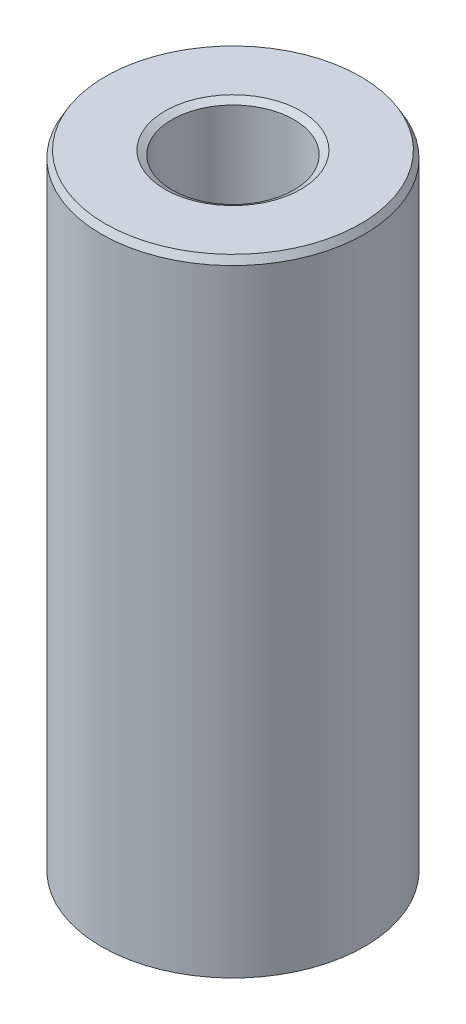
ISO-10303-21;
HEADER;
FILE_DESCRIPTION(('STEP AP214'),'2;1');
FILE_NAME('part.step','',(''),(''),'','','');
FILE_SCHEMA(('AUTOMOTIVE_DESIGN { 1 0 10303 214 1 1 1 1 }'));
ENDSEC;
DATA;
#1=APPLICATION_CONTEXT('core data for automotive mechanical design processes');
#2=APPLICATION_PROTOCOL_DEFINITION('international standard','automotive_design',2000,#1);
#3=PRODUCT_CONTEXT('',#1,'mechanical');
#4=PRODUCT('Part','Part','',(#3));
#5=PRODUCT_RELATED_PRODUCT_CATEGORY('part','',(#4));
#6=PRODUCT_DEFINITION_FORMATION('','',#4);
#7=PRODUCT_DEFINITION_CONTEXT('part definition',#1,'design');
#8=PRODUCT_DEFINITION('design','',#6,#7);
#9=PRODUCT_DEFINITION_SHAPE('','',#8);
#10=(LENGTH_UNIT() NAMED_UNIT(*) SI_UNIT(.MILLI.,.METRE.));
#11=(NAMED_UNIT(*) PLANE_ANGLE_UNIT() SI_UNIT($,.RADIAN.));
#12=(NAMED_UNIT(*) SI_UNIT($,.STERADIAN.) SOLID_ANGLE_UNIT());
#13=UNCERTAINTY_MEASURE_WITH_UNIT(LENGTH_MEASURE(1.E-05),#10,'distance_accuracy_value','');
#14=(GEOMETRIC_REPRESENTATION_CONTEXT(3) GLOBAL_UNCERTAINTY_ASSIGNED_CONTEXT((#13)) GLOBAL_UNIT_ASSIGNED_CONTEXT((#10,
#11,#12)) REPRESENTATION_CONTEXT('',''));
#15=CARTESIAN_POINT('',(0.,0.,0.));
#16=DIRECTION('',(0.,0.,1.));
#17=DIRECTION('',(1.,0.,0.));
#18=AXIS2_PLACEMENT_3D('',#15,#16,#17);
#19=CARTESIAN_POINT('',(0.,202.76600546856,0.));
#20=DIRECTION('',(0.,-1.,0.));
#21=DIRECTION('',(0.,0.,-1.));
#22=AXIS2_PLACEMENT_3D('',#19,#20,#21);
#23=CYLINDRICAL_SURFACE('',#22,42.5);
#24=CARTESIAN_POINT('',(0.,1.29157440370689,0.));
#25=DIRECTION('',(0.,1.,0.));
#26=DIRECTION('',(0.,0.,1.));
#27=AXIS2_PLACEMENT_3D('',#24,#25,#26);
#28=CIRCLE('',#27,42.5);
#29=CARTESIAN_POINT('',(0.,1.29157440370689,42.5));
#30=VERTEX_POINT('',#29);
#31=EDGE_CURVE('E10',#30,#30,#28,.T.);
#32=ORIENTED_EDGE('',*,*,#31,.T.);
#33=EDGE_LOOP('',(#32));
#34=FACE_BOUND('',#33,.T.);
#35=CARTESIAN_POINT('',(0.,200.528932979584,0.));
#36=DIRECTION('',(0.,1.,0.));
#37=DIRECTION('',(0.,0.,1.));
#38=AXIS2_PLACEMENT_3D('',#35,#36,#37);
#39=CIRCLE('',#38,42.5);
#40=CARTESIAN_POINT('',(0.,200.528932979584,42.5));
#41=VERTEX_POINT('',#40);
#42=EDGE_CURVE('E50',#41,#41,#39,.F.);
#43=ORIENTED_EDGE('',*,*,#42,.T.);
#44=EDGE_LOOP('',(#43));
#45=FACE_BOUND('',#44,.T.);
#46=ADVANCED_FACE('F39',(#34,#45),#23,.T.);
#47=CARTESIAN_POINT('',(0.,202.76600546856,0.));
#48=DIRECTION('',(0.,1.,0.));
#49=DIRECTION('',(0.,0.,1.));
#50=AXIS2_PLACEMENT_3D('',#47,#48,#49);
#51=PLANE('',#50);
#52=CARTESIAN_POINT('',(0.,202.76600546856,0.));
#53=DIRECTION('',(0.,1.,0.));
#54=DIRECTION('',(0.,0.,1.));
#55=AXIS2_PLACEMENT_3D('',#52,#53,#54);
#56=CIRCLE('',#55,21.9354266682406);
#57=CARTESIAN_POINT('',(0.,202.76600546856,21.9354266682406));
#58=VERTEX_POINT('',#57);
#59=EDGE_CURVE('E58',#58,#58,#56,.F.);
#60=ORIENTED_EDGE('',*,*,#59,.T.);
#61=EDGE_LOOP('',(#60));
#62=FACE_BOUND('',#61,.T.);
#63=CARTESIAN_POINT('',(0.,202.76600546856,0.));
#64=DIRECTION('',(0.,1.,0.));
#65=DIRECTION('',(0.,0.,1.));
#66=AXIS2_PLACEMENT_3D('',#63,#64,#65);
#67=CIRCLE('',#66,41.2084255962931);
#68=CARTESIAN_POINT('',(0.,202.76600546856,41.2084255962931));
#69=VERTEX_POINT('',#68);
#70=EDGE_CURVE('E61',#69,#69,#67,.T.);
#71=ORIENTED_EDGE('',*,*,#70,.T.);
#72=EDGE_LOOP('',(#71));
#73=FACE_BOUND('',#72,.T.);
#74=ADVANCED_FACE('F88',(#62,#73),#51,.T.);
#75=CARTESIAN_POINT('',(0.,0.,0.));
#76=DIRECTION('',(0.,1.,0.));
#77=DIRECTION('',(0.,0.,1.));
#78=AXIS2_PLACEMENT_3D('',#75,#76,#77);
#79=PLANE('',#78);
#80=CARTESIAN_POINT('',(0.,0.,0.));
#81=DIRECTION('',(0.,1.,0.));
#82=DIRECTION('',(0.,0.,1.));
#83=AXIS2_PLACEMENT_3D('',#80,#81,#82);
#84=CIRCLE('',#83,20.9899285829716);
#85=CARTESIAN_POINT('',(0.,0.,20.9899285829716));
#86=VERTEX_POINT('',#85);
#87=EDGE_CURVE('E51',#86,#86,#84,.T.);
#88=ORIENTED_EDGE('',*,*,#87,.T.);
#89=EDGE_LOOP('',(#88));
#90=FACE_BOUND('',#89,.T.);
#91=CARTESIAN_POINT('',(0.,0.,0.));
#92=DIRECTION('',(0.,1.,0.));
#93=DIRECTION('',(0.,0.,1.));
#94=AXIS2_PLACEMENT_3D('',#91,#92,#93);
#95=CIRCLE('',#94,40.2629275110242);
#96=CARTESIAN_POINT('',(0.,0.,40.2629275110242));
#97=VERTEX_POINT('',#96);
#98=EDGE_CURVE('E54',#97,#97,#95,.F.);
#99=ORIENTED_EDGE('',*,*,#98,.T.);
#100=EDGE_LOOP('',(#99));
#101=FACE_BOUND('',#100,.T.);
#102=ADVANCED_FACE('F83',(#90,#101),#79,.F.);
#103=CARTESIAN_POINT('',(0.,202.76600546856,0.));
#104=DIRECTION('',(0.,-1.,0.));
#105=DIRECTION('',(0.,0.,-1.));
#106=AXIS2_PLACEMENT_3D('',#103,#104,#105);
#107=CYLINDRICAL_SURFACE('',#106,19.6983541792647);
#108=CARTESIAN_POINT('',(0.,201.474431064853,0.));
#109=DIRECTION('',(0.,1.,0.));
#110=DIRECTION('',(0.,0.,1.));
#111=AXIS2_PLACEMENT_3D('',#108,#109,#110);
#112=CIRCLE('',#111,19.6983541792647);
#113=CARTESIAN_POINT('',(0.,201.474431064853,19.6983541792647));
#114=VERTEX_POINT('',#113);
#115=EDGE_CURVE('E67',#114,#114,#112,.T.);
#116=ORIENTED_EDGE('',*,*,#115,.T.);
#117=EDGE_LOOP('',(#116));
#118=FACE_BOUND('',#117,.T.);
#119=CARTESIAN_POINT('',(0.,2.23707248897587,0.));
#120=DIRECTION('',(0.,1.,0.));
#121=DIRECTION('',(0.,0.,1.));
#122=AXIS2_PLACEMENT_3D('',#119,#120,#121);
#123=CIRCLE('',#122,19.6983541792647);
#124=CARTESIAN_POINT('',(0.,2.23707248897587,19.6983541792647));
#125=VERTEX_POINT('',#124);
#126=EDGE_CURVE('E69',#125,#125,#123,.F.);
#127=ORIENTED_EDGE('',*,*,#126,.T.);
#128=EDGE_LOOP('',(#127));
#129=FACE_BOUND('',#128,.T.);
#130=ADVANCED_FACE('F71',(#118,#129),#107,.F.);
#131=CARTESIAN_POINT('',(0.,201.474431064853,0.));
#132=DIRECTION('',(0.,1.,0.));
#133=DIRECTION('',(0.,0.,1.));
#134=AXIS2_PLACEMENT_3D('',#131,#132,#133);
#135=CONICAL_SURFACE('',#134,19.6983541792647,1.0471975511966);
#136=ORIENTED_EDGE('',*,*,#59,.F.);
#137=EDGE_LOOP('',(#136));
#138=FACE_BOUND('',#137,.T.);
#139=ORIENTED_EDGE('',*,*,#115,.F.);
#140=EDGE_LOOP('',(#139));
#141=FACE_BOUND('',#140,.T.);
#142=ADVANCED_FACE('F77',(#138,#141),#135,.F.);
#143=CARTESIAN_POINT('',(0.,0.,0.));
#144=DIRECTION('',(0.,-1.,0.));
#145=DIRECTION('',(0.,0.,-1.));
#146=AXIS2_PLACEMENT_3D('',#143,#144,#145);
#147=CONICAL_SURFACE('',#146,20.9899285829716,0.523598775598289);
#148=ORIENTED_EDGE('',*,*,#126,.F.);
#149=EDGE_LOOP('',(#148));
#150=FACE_BOUND('',#149,.T.);
#151=ORIENTED_EDGE('',*,*,#87,.F.);
#152=EDGE_LOOP('',(#151));
#153=FACE_BOUND('',#152,.T.);
#154=ADVANCED_FACE('F73',(#150,#153),#147,.F.);
#155=CARTESIAN_POINT('',(0.,1.29157440370689,0.));
#156=DIRECTION('',(0.,1.,0.));
#157=DIRECTION('',(0.,0.,1.));
#158=AXIS2_PLACEMENT_3D('',#155,#156,#157);
#159=CONICAL_SURFACE('',#158,42.5,1.0471975511966);
#160=CARTESIAN_POINT('',(0.,0.,40.2629275110242));
#161=CARTESIAN_POINT('',(0.,0.0134539000386146,40.286230349451));
#162=CARTESIAN_POINT('',(0.,0.0269078000772276,40.3095331878778));
#163=CARTESIAN_POINT('',(0.,0.0538156001544536,40.3561388647315));
#164=CARTESIAN_POINT('',(0.,0.0672695001930666,40.3794417031583));
#165=CARTESIAN_POINT('',(0.,0.0941773002702933,40.426047380012));
#166=CARTESIAN_POINT('',(0.,0.107631200308907,40.4493502184388));
#167=CARTESIAN_POINT('',(0.,0.134539000386135,40.4959558952925));
#168=CARTESIAN_POINT('',(0.,0.147992900424748,40.5192587337193));
#169=CARTESIAN_POINT('',(0.,0.174900700501975,40.565864410573));
#170=CARTESIAN_POINT('',(0.,0.188354600540588,40.5891672489998));
#171=CARTESIAN_POINT('',(0.,0.215262400617814,40.6357729258535));
#172=CARTESIAN_POINT('',(0.,0.228716300656428,40.6590757642803));
#173=CARTESIAN_POINT('',(0.,0.255624100733656,40.705681441134));
#174=CARTESIAN_POINT('',(0.,0.269078000772269,40.7289842795608));
#175=CARTESIAN_POINT('',(0.,0.295985800849496,40.7755899564145));
#176=CARTESIAN_POINT('',(0.,0.309439700888109,40.7988927948413));
#177=CARTESIAN_POINT('',(0.,0.336347500965336,40.845498471695));
#178=CARTESIAN_POINT('',(0.,0.34980140100395,40.8688013101218));
#179=CARTESIAN_POINT('',(0.,0.376709201081177,40.9154069869755));
#180=CARTESIAN_POINT('',(0.,0.390163101119789,40.9387098254023));
#181=CARTESIAN_POINT('',(0.,0.417070901197016,40.985315502256));
#182=CARTESIAN_POINT('',(0.,0.43052480123563,41.0086183406828));
#183=CARTESIAN_POINT('',(0.,0.457432601312858,41.0552240175364));
#184=CARTESIAN_POINT('',(0.,0.470886501351471,41.0785268559633));
#185=CARTESIAN_POINT('',(0.,0.497794301428698,41.1251325328169));
#186=CARTESIAN_POINT('',(0.,0.51124820146731,41.1484353712438));
#187=CARTESIAN_POINT('',(0.,0.538156001544537,41.1950410480974));
#188=CARTESIAN_POINT('',(0.,0.551609901583152,41.2183438865243));
#189=CARTESIAN_POINT('',(0.,0.578517701660379,41.2649495633779));
#190=CARTESIAN_POINT('',(0.,0.591971601698991,41.2882524018048));
#191=CARTESIAN_POINT('',(0.,0.618879401776218,41.3348580786584));
#192=CARTESIAN_POINT('',(0.,0.632333301814832,41.3581609170853));
#193=CARTESIAN_POINT('',(0.,0.659241101892059,41.4047665939389));
#194=CARTESIAN_POINT('',(0.,0.672695001930673,41.4280694323658));
#195=CARTESIAN_POINT('',(0.,0.6996028020079,41.4746751092194));
#196=CARTESIAN_POINT('',(0.,0.713056702046512,41.4979779476462));
#197=CARTESIAN_POINT('',(0.,0.739964502123739,41.5445836244999));
#198=CARTESIAN_POINT('',(0.,0.753418402162353,41.5678864629267));
#199=CARTESIAN_POINT('',(0.,0.78032620223958,41.6144921397804));
#200=CARTESIAN_POINT('',(0.,0.793780102278194,41.6377949782072));
#201=CARTESIAN_POINT('',(0.,0.82068790235542,41.6844006550609));
#202=CARTESIAN_POINT('',(0.,0.834141802394033,41.7077034934877));
#203=CARTESIAN_POINT('',(0.,0.86104960247126,41.7543091703414));
#204=CARTESIAN_POINT('',(0.,0.874503502509875,41.7776120087682));
#205=CARTESIAN_POINT('',(0.,0.901411302587102,41.8242176856219));
#206=CARTESIAN_POINT('',(0.,0.914865202625714,41.8475205240487));
#207=CARTESIAN_POINT('',(0.,0.941773002702941,41.8941262009024));
#208=CARTESIAN_POINT('',(0.,0.955226902741554,41.9174290393292));
#209=CARTESIAN_POINT('',(0.,0.982134702818782,41.9640347161829));
#210=CARTESIAN_POINT('',(0.,0.995588602857396,41.9873375546097));
#211=CARTESIAN_POINT('',(0.,1.02249640293462,42.0339432314634));
#212=CARTESIAN_POINT('',(0.,1.03595030297324,42.0572460698902));
#213=CARTESIAN_POINT('',(0.,1.06285810305046,42.1038517467439));
#214=CARTESIAN_POINT('',(0.,1.07631200308908,42.1271545851707));
#215=CARTESIAN_POINT('',(0.,1.1032198031663,42.1737602620244));
#216=CARTESIAN_POINT('',(0.,1.11667370320492,42.1970631004512));
#217=CARTESIAN_POINT('',(0.,1.14358150328214,42.2436687773049));
#218=CARTESIAN_POINT('',(0.,1.15703540332076,42.2669716157317));
#219=CARTESIAN_POINT('',(0.,1.18394320339798,42.3135772925854));
#220=CARTESIAN_POINT('',(0.,1.1973971034366,42.3368801310122));
#221=CARTESIAN_POINT('',(0.,1.22430490351382,42.3834858078658));
#222=CARTESIAN_POINT('',(0.,1.23775880355244,42.4067886462927));
#223=CARTESIAN_POINT('',(0.,1.26466660362966,42.4533943231463));
#224=CARTESIAN_POINT('',(0.,1.27812050366828,42.4766971615732));
#225=CARTESIAN_POINT('',(0.,1.29157440370689,42.5));
#226=B_SPLINE_CURVE_WITH_KNOTS('',3,(#160,#161,#162,#163,#164,#165,#166,#167,#168,#169,#170,
#171,#172,#173,#174,#175,#176,#177,#178,#179,#180,#181,#182,#183,#184,#185,#186,#187,#188,#189,
#190,#191,#192,#193,#194,#195,#196,#197,#198,#199,#200,#201,#202,#203,#204,#205,#206,#207,#208,
#209,#210,#211,#212,#213,#214,#215,#216,#217,#218,#219,#220,#221,#222,#223,#224,#225),
.UNSPECIFIED.,.F.,.F.,(4,2,2,2,2,2,2,2,2,2,2,2,2,2,2,2,2,2,2,2,2,2,2,2,2,2,2,2,2,2,2,2,4),(0.,
0.0807234002316792,0.161446800463364,0.242170200695044,0.322893600926723,0.403617001158408,
0.484340401390087,0.565063801621766,0.645787201853451,0.726510602085131,0.807234002316816,
0.887957402548495,0.968680802780174,1.04940420301186,1.13012760324354,1.21085100347522,
1.2915744037069,1.37229780393858,1.45302120417027,1.53374460440195,1.61446800463363,
1.69519140486531,1.77591480509699,1.85663820532868,1.93736160556035,2.01808500579203,
2.09880840602372,2.1795318062554,2.26025520648708,2.34097860671876,2.42170200695044,
2.50242540718213,2.5831488074138),.UNSPECIFIED.);
#227=EDGE_CURVE('BSEAM76',#97,#30,#226,.T.);
#228=ORIENTED_EDGE('',*,*,#98,.F.);
#229=ORIENTED_EDGE('',*,*,#31,.F.);
#230=ORIENTED_EDGE('',*,*,#227,.T.);
#231=ORIENTED_EDGE('',*,*,#227,.F.);
#232=EDGE_LOOP('',(#228,#230,#229,#231));
#233=FACE_BOUND('',#232,.T.);
#234=ADVANCED_FACE('F76',(#233),#159,.T.);
#235=CARTESIAN_POINT('',(0.,202.76600546856,0.));
#236=DIRECTION('',(0.,-1.,0.));
#237=DIRECTION('',(0.,0.,-1.));
#238=AXIS2_PLACEMENT_3D('',#235,#236,#237);
#239=CONICAL_SURFACE('',#238,41.2084255962931,0.523598775598288);
#240=ORIENTED_EDGE('',*,*,#42,.F.);
#241=EDGE_LOOP('',(#240));
#242=FACE_BOUND('',#241,.T.);
#243=ORIENTED_EDGE('',*,*,#70,.F.);
#244=EDGE_LOOP('',(#243));
#245=FACE_BOUND('',#244,.T.);
#246=ADVANCED_FACE('F45',(#242,#245),#239,.T.);
#247=CLOSED_SHELL('',(#46,#74,#102,#130,#142,#154,#234,#246));
#248=MANIFOLD_SOLID_BREP('B2',#247);
#249=ADVANCED_BREP_SHAPE_REPRESENTATION('',(#18,#248),#14);
#250=SHAPE_DEFINITION_REPRESENTATION(#9,#249);
ENDSEC;
END-ISO-10303-21;
